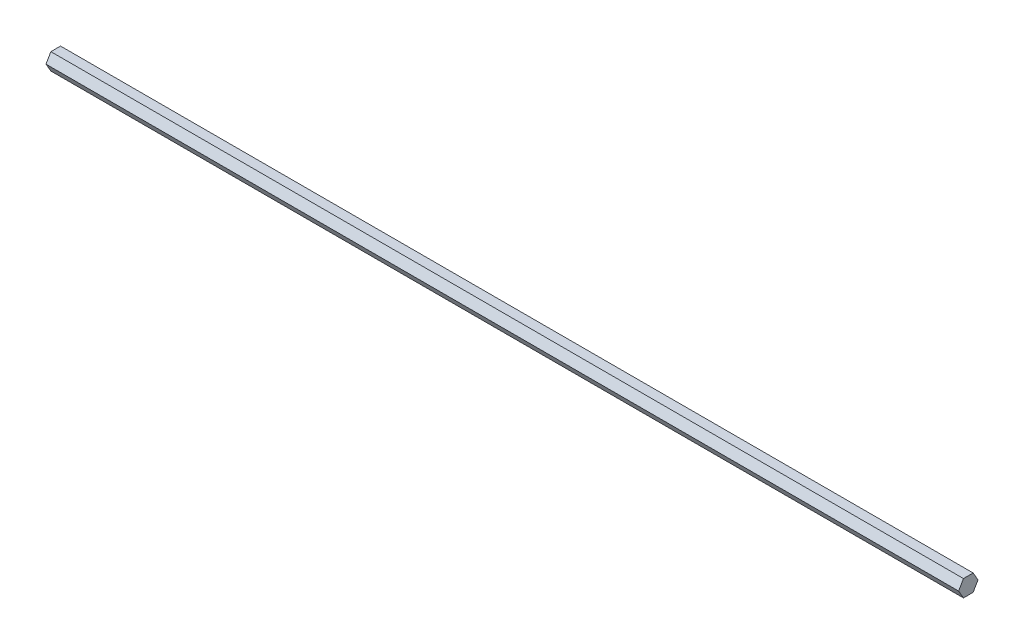
ISO-10303-21;
HEADER;
FILE_DESCRIPTION(('STEP AP214'),'2;1');
FILE_NAME('part.step','',(''),(''),'','','');
FILE_SCHEMA(('AUTOMOTIVE_DESIGN { 1 0 10303 214 1 1 1 1 }'));
ENDSEC;
DATA;
#1=APPLICATION_CONTEXT('core data for automotive mechanical design processes');
#2=APPLICATION_PROTOCOL_DEFINITION('international standard','automotive_design',2000,#1);
#3=PRODUCT_CONTEXT('',#1,'mechanical');
#4=PRODUCT('Part','Part','',(#3));
#5=PRODUCT_RELATED_PRODUCT_CATEGORY('part','',(#4));
#6=PRODUCT_DEFINITION_FORMATION('','',#4);
#7=PRODUCT_DEFINITION_CONTEXT('part definition',#1,'design');
#8=PRODUCT_DEFINITION('design','',#6,#7);
#9=PRODUCT_DEFINITION_SHAPE('','',#8);
#10=(LENGTH_UNIT() NAMED_UNIT(*) SI_UNIT(.MILLI.,.METRE.));
#11=(NAMED_UNIT(*) PLANE_ANGLE_UNIT() SI_UNIT($,.RADIAN.));
#12=(NAMED_UNIT(*) SI_UNIT($,.STERADIAN.) SOLID_ANGLE_UNIT());
#13=UNCERTAINTY_MEASURE_WITH_UNIT(LENGTH_MEASURE(1.E-05),#10,'distance_accuracy_value','');
#14=(GEOMETRIC_REPRESENTATION_CONTEXT(3) GLOBAL_UNCERTAINTY_ASSIGNED_CONTEXT((#13)) GLOBAL_UNIT_ASSIGNED_CONTEXT((#10,
#11,#12)) REPRESENTATION_CONTEXT('',''));
#15=CARTESIAN_POINT('',(0.,0.,0.));
#16=DIRECTION('',(0.,0.,1.));
#17=DIRECTION('',(1.,0.,0.));
#18=AXIS2_PLACEMENT_3D('',#15,#16,#17);
#19=CARTESIAN_POINT('',(690.372,-6.35,-3.66617420935412));
#20=DIRECTION('',(0.,0.499999999999999,0.866025403784439));
#21=DIRECTION('',(0.,-0.866025403784439,0.499999999999999));
#22=AXIS2_PLACEMENT_3D('',#19,#20,#21);
#23=PLANE('',#22);
#24=DIRECTION('',(0.,0.866025403784439,-0.499999999999999));
#25=VECTOR('',#24,1.);
#26=CARTESIAN_POINT('',(0.,-6.35,-3.66617420935412));
#27=LINE('',#26,#25);
#28=CARTESIAN_POINT('',(0.,-6.35,-3.66617420935412));
#29=VERTEX_POINT('',#28);
#30=CARTESIAN_POINT('',(0.,0.,-7.33234841870824));
#31=VERTEX_POINT('',#30);
#32=EDGE_CURVE('E117',#29,#31,#27,.T.);
#33=ORIENTED_EDGE('',*,*,#32,.T.);
#34=DIRECTION('',(-1.,0.,0.));
#35=VECTOR('',#34,1.);
#36=CARTESIAN_POINT('',(690.372,0.,-7.33234841870824));
#37=LINE('',#36,#35);
#38=CARTESIAN_POINT('',(690.372,0.,-7.33234841870824));
#39=VERTEX_POINT('',#38);
#40=EDGE_CURVE('E11',#39,#31,#37,.T.);
#41=ORIENTED_EDGE('',*,*,#40,.F.);
#42=DIRECTION('',(0.,0.866025403784439,-0.499999999999999));
#43=VECTOR('',#42,1.);
#44=CARTESIAN_POINT('',(690.372,-6.35,-3.66617420935412));
#45=LINE('',#44,#43);
#46=CARTESIAN_POINT('',(690.372,-6.35,-3.66617420935412));
#47=VERTEX_POINT('',#46);
#48=EDGE_CURVE('E127',#47,#39,#45,.T.);
#49=ORIENTED_EDGE('',*,*,#48,.F.);
#50=DIRECTION('',(-1.,0.,0.));
#51=VECTOR('',#50,1.);
#52=CARTESIAN_POINT('',(690.372,-6.35,-3.66617420935412));
#53=LINE('',#52,#51);
#54=EDGE_CURVE('E113',#47,#29,#53,.T.);
#55=ORIENTED_EDGE('',*,*,#54,.T.);
#56=EDGE_LOOP('',(#33,#41,#49,#55));
#57=FACE_BOUND('',#56,.T.);
#58=ADVANCED_FACE('F33',(#57),#23,.F.);
#59=CARTESIAN_POINT('',(690.372,0.,-7.33234841870824));
#60=DIRECTION('',(0.,-0.5,0.866025403784439));
#61=DIRECTION('',(0.,-0.866025403784439,-0.5));
#62=AXIS2_PLACEMENT_3D('',#59,#60,#61);
#63=PLANE('',#62);
#64=DIRECTION('',(0.,0.866025403784439,0.5));
#65=VECTOR('',#64,1.);
#66=CARTESIAN_POINT('',(0.,0.,-7.33234841870824));
#67=LINE('',#66,#65);
#68=CARTESIAN_POINT('',(0.,6.35000000000001,-3.66617420935412));
#69=VERTEX_POINT('',#68);
#70=EDGE_CURVE('E120',#31,#69,#67,.T.);
#71=ORIENTED_EDGE('',*,*,#70,.T.);
#72=DIRECTION('',(-1.,0.,0.));
#73=VECTOR('',#72,1.);
#74=CARTESIAN_POINT('',(690.372,6.35000000000001,-3.66617420935412));
#75=LINE('',#74,#73);
#76=CARTESIAN_POINT('',(690.372,6.35000000000001,-3.66617420935412));
#77=VERTEX_POINT('',#76);
#78=EDGE_CURVE('E41',#77,#69,#75,.T.);
#79=ORIENTED_EDGE('',*,*,#78,.F.);
#80=DIRECTION('',(0.,0.866025403784439,0.5));
#81=VECTOR('',#80,1.);
#82=CARTESIAN_POINT('',(690.372,0.,-7.33234841870824));
#83=LINE('',#82,#81);
#84=EDGE_CURVE('E86',#39,#77,#83,.T.);
#85=ORIENTED_EDGE('',*,*,#84,.F.);
#86=ORIENTED_EDGE('',*,*,#40,.T.);
#87=EDGE_LOOP('',(#71,#79,#85,#86));
#88=FACE_BOUND('',#87,.T.);
#89=ADVANCED_FACE('F151',(#88),#63,.F.);
#90=CARTESIAN_POINT('',(690.372,6.35000000000001,-3.66617420935412));
#91=DIRECTION('',(0.,-1.,0.));
#92=DIRECTION('',(0.,0.,-1.));
#93=AXIS2_PLACEMENT_3D('',#90,#91,#92);
#94=PLANE('',#93);
#95=DIRECTION('',(0.,0.,1.));
#96=VECTOR('',#95,1.);
#97=CARTESIAN_POINT('',(0.,6.35000000000001,-3.66617420935412));
#98=LINE('',#97,#96);
#99=CARTESIAN_POINT('',(0.,6.35000000000001,3.66617420935413));
#100=VERTEX_POINT('',#99);
#101=EDGE_CURVE('E122',#69,#100,#98,.T.);
#102=ORIENTED_EDGE('',*,*,#101,.T.);
#103=DIRECTION('',(-1.,0.,0.));
#104=VECTOR('',#103,1.);
#105=CARTESIAN_POINT('',(690.372,6.35000000000001,3.66617420935413));
#106=LINE('',#105,#104);
#107=CARTESIAN_POINT('',(690.372,6.35000000000001,3.66617420935413));
#108=VERTEX_POINT('',#107);
#109=EDGE_CURVE('E108',#108,#100,#106,.T.);
#110=ORIENTED_EDGE('',*,*,#109,.F.);
#111=DIRECTION('',(0.,0.,1.));
#112=VECTOR('',#111,1.);
#113=CARTESIAN_POINT('',(690.372,6.35000000000001,-3.66617420935412));
#114=LINE('',#113,#112);
#115=EDGE_CURVE('E99',#77,#108,#114,.T.);
#116=ORIENTED_EDGE('',*,*,#115,.F.);
#117=ORIENTED_EDGE('',*,*,#78,.T.);
#118=EDGE_LOOP('',(#102,#110,#116,#117));
#119=FACE_BOUND('',#118,.T.);
#120=ADVANCED_FACE('F133',(#119),#94,.F.);
#121=CARTESIAN_POINT('',(690.372,6.35000000000001,3.66617420935413));
#122=DIRECTION('',(0.,-0.5,-0.866025403784439));
#123=DIRECTION('',(0.,0.866025403784439,-0.5));
#124=AXIS2_PLACEMENT_3D('',#121,#122,#123);
#125=PLANE('',#124);
#126=DIRECTION('',(0.,-0.866025403784439,0.5));
#127=VECTOR('',#126,1.);
#128=CARTESIAN_POINT('',(0.,6.35000000000001,3.66617420935413));
#129=LINE('',#128,#127);
#130=CARTESIAN_POINT('',(0.,0.,7.33234841870825));
#131=VERTEX_POINT('',#130);
#132=EDGE_CURVE('E107',#100,#131,#129,.T.);
#133=ORIENTED_EDGE('',*,*,#132,.T.);
#134=DIRECTION('',(-1.,0.,0.));
#135=VECTOR('',#134,1.);
#136=CARTESIAN_POINT('',(690.372,0.,7.33234841870825));
#137=LINE('',#136,#135);
#138=CARTESIAN_POINT('',(690.372,0.,7.33234841870825));
#139=VERTEX_POINT('',#138);
#140=EDGE_CURVE('E104',#139,#131,#137,.T.);
#141=ORIENTED_EDGE('',*,*,#140,.F.);
#142=DIRECTION('',(0.,-0.866025403784439,0.5));
#143=VECTOR('',#142,1.);
#144=CARTESIAN_POINT('',(690.372,6.35000000000001,3.66617420935413));
#145=LINE('',#144,#143);
#146=EDGE_CURVE('E93',#108,#139,#145,.T.);
#147=ORIENTED_EDGE('',*,*,#146,.F.);
#148=ORIENTED_EDGE('',*,*,#109,.T.);
#149=EDGE_LOOP('',(#133,#141,#147,#148));
#150=FACE_BOUND('',#149,.T.);
#151=ADVANCED_FACE('F105',(#150),#125,.F.);
#152=CARTESIAN_POINT('',(690.372,0.,7.33234841870825));
#153=DIRECTION('',(0.,0.5,-0.866025403784439));
#154=DIRECTION('',(0.,0.866025403784439,0.5));
#155=AXIS2_PLACEMENT_3D('',#152,#153,#154);
#156=PLANE('',#155);
#157=DIRECTION('',(0.,-0.866025403784439,-0.5));
#158=VECTOR('',#157,1.);
#159=CARTESIAN_POINT('',(0.,0.,7.33234841870825));
#160=LINE('',#159,#158);
#161=CARTESIAN_POINT('',(0.,-6.35,3.66617420935413));
#162=VERTEX_POINT('',#161);
#163=EDGE_CURVE('E72',#131,#162,#160,.T.);
#164=ORIENTED_EDGE('',*,*,#163,.T.);
#165=DIRECTION('',(-1.,0.,0.));
#166=VECTOR('',#165,1.);
#167=CARTESIAN_POINT('',(690.372,-6.35,3.66617420935413));
#168=LINE('',#167,#166);
#169=CARTESIAN_POINT('',(690.372,-6.35,3.66617420935413));
#170=VERTEX_POINT('',#169);
#171=EDGE_CURVE('E109',#170,#162,#168,.T.);
#172=ORIENTED_EDGE('',*,*,#171,.F.);
#173=DIRECTION('',(0.,-0.866025403784439,-0.5));
#174=VECTOR('',#173,1.);
#175=CARTESIAN_POINT('',(690.372,0.,7.33234841870825));
#176=LINE('',#175,#174);
#177=EDGE_CURVE('E97',#139,#170,#176,.T.);
#178=ORIENTED_EDGE('',*,*,#177,.F.);
#179=ORIENTED_EDGE('',*,*,#140,.T.);
#180=EDGE_LOOP('',(#164,#172,#178,#179));
#181=FACE_BOUND('',#180,.T.);
#182=ADVANCED_FACE('F111',(#181),#156,.F.);
#183=CARTESIAN_POINT('',(690.372,-6.35,3.66617420935413));
#184=DIRECTION('',(0.,1.,0.));
#185=DIRECTION('',(0.,0.,1.));
#186=AXIS2_PLACEMENT_3D('',#183,#184,#185);
#187=PLANE('',#186);
#188=DIRECTION('',(0.,0.,-1.));
#189=VECTOR('',#188,1.);
#190=CARTESIAN_POINT('',(0.,-6.35,3.66617420935413));
#191=LINE('',#190,#189);
#192=EDGE_CURVE('E78',#162,#29,#191,.T.);
#193=ORIENTED_EDGE('',*,*,#192,.T.);
#194=ORIENTED_EDGE('',*,*,#54,.F.);
#195=DIRECTION('',(0.,0.,-1.));
#196=VECTOR('',#195,1.);
#197=CARTESIAN_POINT('',(690.372,-6.35,3.66617420935413));
#198=LINE('',#197,#196);
#199=EDGE_CURVE('E49',#170,#47,#198,.T.);
#200=ORIENTED_EDGE('',*,*,#199,.F.);
#201=ORIENTED_EDGE('',*,*,#171,.T.);
#202=EDGE_LOOP('',(#193,#194,#200,#201));
#203=FACE_BOUND('',#202,.T.);
#204=ADVANCED_FACE('F140',(#203),#187,.F.);
#205=CARTESIAN_POINT('',(690.372,0.,0.));
#206=DIRECTION('',(1.,0.,0.));
#207=DIRECTION('',(0.,0.,-1.));
#208=AXIS2_PLACEMENT_3D('',#205,#206,#207);
#209=PLANE('',#208);
#210=ORIENTED_EDGE('',*,*,#48,.T.);
#211=ORIENTED_EDGE('',*,*,#84,.T.);
#212=ORIENTED_EDGE('',*,*,#115,.T.);
#213=ORIENTED_EDGE('',*,*,#146,.T.);
#214=ORIENTED_EDGE('',*,*,#177,.T.);
#215=ORIENTED_EDGE('',*,*,#199,.T.);
#216=EDGE_LOOP('',(#210,#211,#212,#213,#214,#215));
#217=FACE_BOUND('',#216,.T.);
#218=ADVANCED_FACE('F95',(#217),#209,.T.);
#219=CARTESIAN_POINT('',(0.,0.,0.));
#220=DIRECTION('',(1.,0.,0.));
#221=DIRECTION('',(0.,0.,-1.));
#222=AXIS2_PLACEMENT_3D('',#219,#220,#221);
#223=PLANE('',#222);
#224=ORIENTED_EDGE('',*,*,#32,.F.);
#225=ORIENTED_EDGE('',*,*,#192,.F.);
#226=ORIENTED_EDGE('',*,*,#163,.F.);
#227=ORIENTED_EDGE('',*,*,#132,.F.);
#228=ORIENTED_EDGE('',*,*,#101,.F.);
#229=ORIENTED_EDGE('',*,*,#70,.F.);
#230=EDGE_LOOP('',(#224,#225,#226,#227,#228,#229));
#231=FACE_BOUND('',#230,.T.);
#232=ADVANCED_FACE('F136',(#231),#223,.F.);
#233=CLOSED_SHELL('',(#58,#89,#120,#151,#182,#204,#218,#232));
#234=MANIFOLD_SOLID_BREP('B2',#233);
#235=ADVANCED_BREP_SHAPE_REPRESENTATION('',(#18,#234),#14);
#236=SHAPE_DEFINITION_REPRESENTATION(#9,#235);
ENDSEC;
END-ISO-10303-21;
